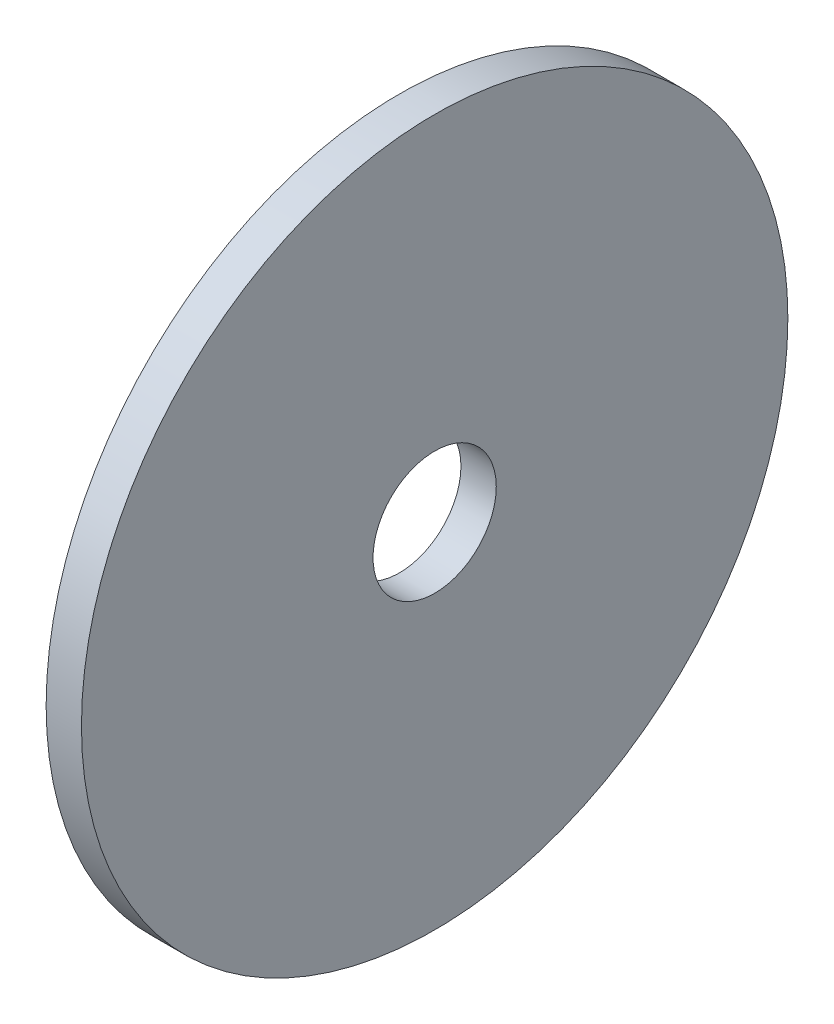
ISO-10303-21;
HEADER;
FILE_DESCRIPTION(('STEP AP214'),'2;1');
FILE_NAME('part.step','',(''),(''),'','','');
FILE_SCHEMA(('AUTOMOTIVE_DESIGN { 1 0 10303 214 1 1 1 1 }'));
ENDSEC;
DATA;
#1=APPLICATION_CONTEXT('core data for automotive mechanical design processes');
#2=APPLICATION_PROTOCOL_DEFINITION('international standard','automotive_design',2000,#1);
#3=PRODUCT_CONTEXT('',#1,'mechanical');
#4=PRODUCT('Part','Part','',(#3));
#5=PRODUCT_RELATED_PRODUCT_CATEGORY('part','',(#4));
#6=PRODUCT_DEFINITION_FORMATION('','',#4);
#7=PRODUCT_DEFINITION_CONTEXT('part definition',#1,'design');
#8=PRODUCT_DEFINITION('design','',#6,#7);
#9=PRODUCT_DEFINITION_SHAPE('','',#8);
#10=(LENGTH_UNIT() NAMED_UNIT(*) SI_UNIT(.MILLI.,.METRE.));
#11=(NAMED_UNIT(*) PLANE_ANGLE_UNIT() SI_UNIT($,.RADIAN.));
#12=(NAMED_UNIT(*) SI_UNIT($,.STERADIAN.) SOLID_ANGLE_UNIT());
#13=UNCERTAINTY_MEASURE_WITH_UNIT(LENGTH_MEASURE(1.E-05),#10,'distance_accuracy_value','');
#14=(GEOMETRIC_REPRESENTATION_CONTEXT(3) GLOBAL_UNCERTAINTY_ASSIGNED_CONTEXT((#13)) GLOBAL_UNIT_ASSIGNED_CONTEXT((#10,
#11,#12)) REPRESENTATION_CONTEXT('',''));
#15=CARTESIAN_POINT('',(0.,0.,0.));
#16=DIRECTION('',(0.,0.,1.));
#17=DIRECTION('',(1.,0.,0.));
#18=AXIS2_PLACEMENT_3D('',#15,#16,#17);
#19=CARTESIAN_POINT('',(515.112,0.,0.));
#20=DIRECTION('',(1.,0.,0.));
#21=DIRECTION('',(0.,0.,-1.));
#22=AXIS2_PLACEMENT_3D('',#19,#20,#21);
#23=PLANE('',#22);
#24=CARTESIAN_POINT('',(515.112,0.,0.));
#25=DIRECTION('',(1.,0.,0.));
#26=DIRECTION('',(0.,0.,-1.));
#27=AXIS2_PLACEMENT_3D('',#24,#25,#26);
#28=CIRCLE('',#27,9.525);
#29=CARTESIAN_POINT('',(515.112,0.,-9.525));
#30=VERTEX_POINT('',#29);
#31=EDGE_CURVE('E59',#30,#30,#28,.T.);
#32=ORIENTED_EDGE('',*,*,#31,.T.);
#33=EDGE_LOOP('',(#32));
#34=FACE_BOUND('',#33,.T.);
#35=CARTESIAN_POINT('',(515.112,0.,0.));
#36=DIRECTION('',(1.,0.,0.));
#37=DIRECTION('',(0.,0.,-1.));
#38=AXIS2_PLACEMENT_3D('',#35,#36,#37);
#39=CIRCLE('',#38,54.6077792733118);
#40=CARTESIAN_POINT('',(515.112,0.,-54.6077792733118));
#41=VERTEX_POINT('',#40);
#42=EDGE_CURVE('E11',#41,#41,#39,.T.);
#43=ORIENTED_EDGE('',*,*,#42,.F.);
#44=EDGE_LOOP('',(#43));
#45=FACE_BOUND('',#44,.T.);
#46=ADVANCED_FACE('F46',(#34,#45),#23,.F.);
#47=CARTESIAN_POINT('',(515.112,0.,0.));
#48=DIRECTION('',(1.,0.,0.));
#49=DIRECTION('',(0.,0.,-1.));
#50=AXIS2_PLACEMENT_3D('',#47,#48,#49);
#51=CYLINDRICAL_SURFACE('',#50,54.6077792733118);
#52=ORIENTED_EDGE('',*,*,#42,.T.);
#53=EDGE_LOOP('',(#52));
#54=FACE_BOUND('',#53,.T.);
#55=CARTESIAN_POINT('',(520.573,0.,0.));
#56=DIRECTION('',(1.,0.,0.));
#57=DIRECTION('',(0.,0.,-1.));
#58=AXIS2_PLACEMENT_3D('',#55,#56,#57);
#59=CIRCLE('',#58,54.6077792733118);
#60=CARTESIAN_POINT('',(520.573,0.,-54.6077792733118));
#61=VERTEX_POINT('',#60);
#62=EDGE_CURVE('E50',#61,#61,#59,.T.);
#63=ORIENTED_EDGE('',*,*,#62,.F.);
#64=EDGE_LOOP('',(#63));
#65=FACE_BOUND('',#64,.T.);
#66=ADVANCED_FACE('F79',(#54,#65),#51,.T.);
#67=CARTESIAN_POINT('',(520.573,0.,0.));
#68=DIRECTION('',(1.,0.,0.));
#69=DIRECTION('',(0.,0.,-1.));
#70=AXIS2_PLACEMENT_3D('',#67,#68,#69);
#71=PLANE('',#70);
#72=CARTESIAN_POINT('',(520.573,0.,0.));
#73=DIRECTION('',(1.,0.,0.));
#74=DIRECTION('',(0.,0.,-1.));
#75=AXIS2_PLACEMENT_3D('',#72,#73,#74);
#76=CIRCLE('',#75,9.525);
#77=CARTESIAN_POINT('',(520.573,0.,-9.525));
#78=VERTEX_POINT('',#77);
#79=EDGE_CURVE('E61',#78,#78,#76,.T.);
#80=ORIENTED_EDGE('',*,*,#79,.F.);
#81=EDGE_LOOP('',(#80));
#82=FACE_BOUND('',#81,.T.);
#83=ORIENTED_EDGE('',*,*,#62,.T.);
#84=EDGE_LOOP('',(#83));
#85=FACE_BOUND('',#84,.T.);
#86=ADVANCED_FACE('F48',(#82,#85),#71,.T.);
#87=CARTESIAN_POINT('',(515.112,0.,0.));
#88=DIRECTION('',(1.,0.,0.));
#89=DIRECTION('',(0.,0.,-1.));
#90=AXIS2_PLACEMENT_3D('',#87,#88,#89);
#91=CYLINDRICAL_SURFACE('',#90,9.525);
#92=ORIENTED_EDGE('',*,*,#31,.F.);
#93=EDGE_LOOP('',(#92));
#94=FACE_BOUND('',#93,.T.);
#95=ORIENTED_EDGE('',*,*,#79,.T.);
#96=EDGE_LOOP('',(#95));
#97=FACE_BOUND('',#96,.T.);
#98=ADVANCED_FACE('F71',(#94,#97),#91,.F.);
#99=CLOSED_SHELL('',(#46,#66,#86,#98));
#100=MANIFOLD_SOLID_BREP('B2',#99);
#101=ADVANCED_BREP_SHAPE_REPRESENTATION('',(#18,#100),#14);
#102=SHAPE_DEFINITION_REPRESENTATION(#9,#101);
ENDSEC;
END-ISO-10303-21;
